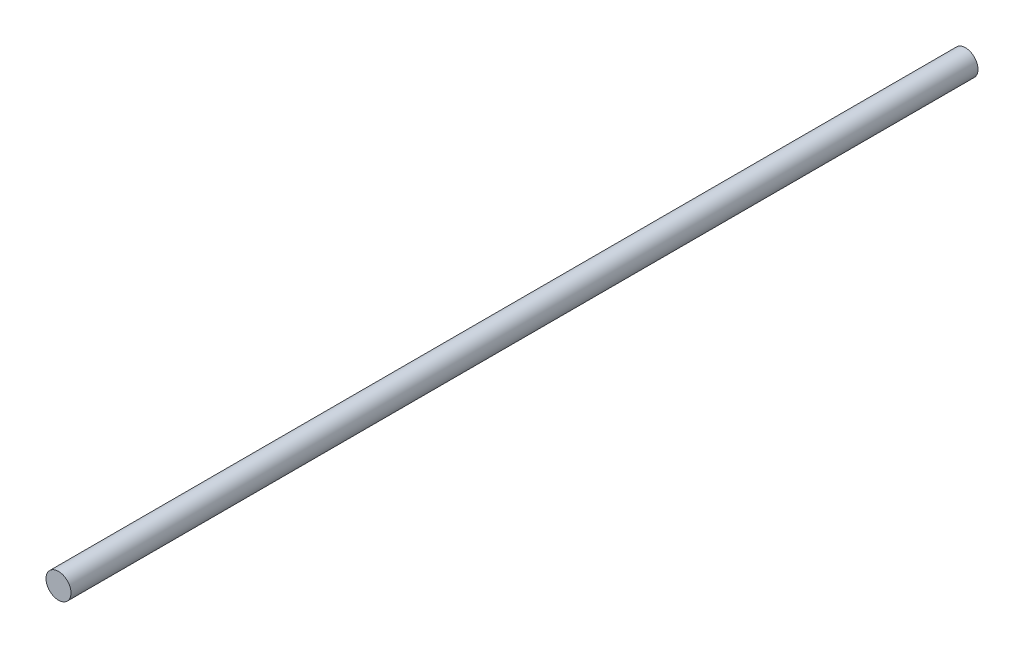
ISO-10303-21;
HEADER;
FILE_DESCRIPTION(('STEP AP214'),'2;1');
FILE_NAME('part.step','',(''),(''),'','','');
FILE_SCHEMA(('AUTOMOTIVE_DESIGN { 1 0 10303 214 1 1 1 1 }'));
ENDSEC;
DATA;
#1=APPLICATION_CONTEXT('core data for automotive mechanical design processes');
#2=APPLICATION_PROTOCOL_DEFINITION('international standard','automotive_design',2000,#1);
#3=PRODUCT_CONTEXT('',#1,'mechanical');
#4=PRODUCT('Part','Part','',(#3));
#5=PRODUCT_RELATED_PRODUCT_CATEGORY('part','',(#4));
#6=PRODUCT_DEFINITION_FORMATION('','',#4);
#7=PRODUCT_DEFINITION_CONTEXT('part definition',#1,'design');
#8=PRODUCT_DEFINITION('design','',#6,#7);
#9=PRODUCT_DEFINITION_SHAPE('','',#8);
#10=(LENGTH_UNIT() NAMED_UNIT(*) SI_UNIT(.MILLI.,.METRE.));
#11=(NAMED_UNIT(*) PLANE_ANGLE_UNIT() SI_UNIT($,.RADIAN.));
#12=(NAMED_UNIT(*) SI_UNIT($,.STERADIAN.) SOLID_ANGLE_UNIT());
#13=UNCERTAINTY_MEASURE_WITH_UNIT(LENGTH_MEASURE(1.E-05),#10,'distance_accuracy_value','');
#14=(GEOMETRIC_REPRESENTATION_CONTEXT(3) GLOBAL_UNCERTAINTY_ASSIGNED_CONTEXT((#13)) GLOBAL_UNIT_ASSIGNED_CONTEXT((#10,
#11,#12)) REPRESENTATION_CONTEXT('',''));
#15=CARTESIAN_POINT('',(0.,0.,0.));
#16=DIRECTION('',(0.,0.,1.));
#17=DIRECTION('',(1.,0.,0.));
#18=AXIS2_PLACEMENT_3D('',#15,#16,#17);
#19=CARTESIAN_POINT('',(-32.4003719135817,2.11877907861435,290.));
#20=DIRECTION('',(0.,0.,-1.));
#21=DIRECTION('',(-1.,0.,0.));
#22=AXIS2_PLACEMENT_3D('',#19,#20,#21);
#23=CYLINDRICAL_SURFACE('',#22,4.);
#24=CARTESIAN_POINT('',(-32.4003719135817,2.11877907861435,290.));
#25=DIRECTION('',(0.,0.,1.));
#26=DIRECTION('',(1.,0.,0.));
#27=AXIS2_PLACEMENT_3D('',#24,#25,#26);
#28=CIRCLE('',#27,4.);
#29=CARTESIAN_POINT('',(-28.4003719135817,2.11877907861435,290.));
#30=VERTEX_POINT('',#29);
#31=EDGE_CURVE('E10',#30,#30,#28,.T.);
#32=ORIENTED_EDGE('',*,*,#31,.F.);
#33=EDGE_LOOP('',(#32));
#34=FACE_BOUND('',#33,.T.);
#35=CARTESIAN_POINT('',(-32.4003719135817,2.11877907861435,0.));
#36=DIRECTION('',(0.,0.,1.));
#37=DIRECTION('',(1.,0.,0.));
#38=AXIS2_PLACEMENT_3D('',#35,#36,#37);
#39=CIRCLE('',#38,4.);
#40=CARTESIAN_POINT('',(-28.4003719135817,2.11877907861435,0.));
#41=VERTEX_POINT('',#40);
#42=EDGE_CURVE('E33',#41,#41,#39,.T.);
#43=ORIENTED_EDGE('',*,*,#42,.T.);
#44=EDGE_LOOP('',(#43));
#45=FACE_BOUND('',#44,.T.);
#46=ADVANCED_FACE('F30',(#34,#45),#23,.T.);
#47=CARTESIAN_POINT('',(-32.4003719135817,2.11877907861435,290.));
#48=DIRECTION('',(0.,0.,1.));
#49=DIRECTION('',(1.,0.,0.));
#50=AXIS2_PLACEMENT_3D('',#47,#48,#49);
#51=PLANE('',#50);
#52=ORIENTED_EDGE('',*,*,#31,.T.);
#53=EDGE_LOOP('',(#52));
#54=FACE_BOUND('',#53,.T.);
#55=ADVANCED_FACE('F45',(#54),#51,.T.);
#56=CARTESIAN_POINT('',(-32.4003719135817,2.11877907861435,0.));
#57=DIRECTION('',(0.,0.,1.));
#58=DIRECTION('',(1.,0.,0.));
#59=AXIS2_PLACEMENT_3D('',#56,#57,#58);
#60=PLANE('',#59);
#61=ORIENTED_EDGE('',*,*,#42,.F.);
#62=EDGE_LOOP('',(#61));
#63=FACE_BOUND('',#62,.T.);
#64=ADVANCED_FACE('F43',(#63),#60,.F.);
#65=CLOSED_SHELL('',(#46,#55,#64));
#66=MANIFOLD_SOLID_BREP('B2',#65);
#67=ADVANCED_BREP_SHAPE_REPRESENTATION('',(#18,#66),#14);
#68=SHAPE_DEFINITION_REPRESENTATION(#9,#67);
ENDSEC;
END-ISO-10303-21;
